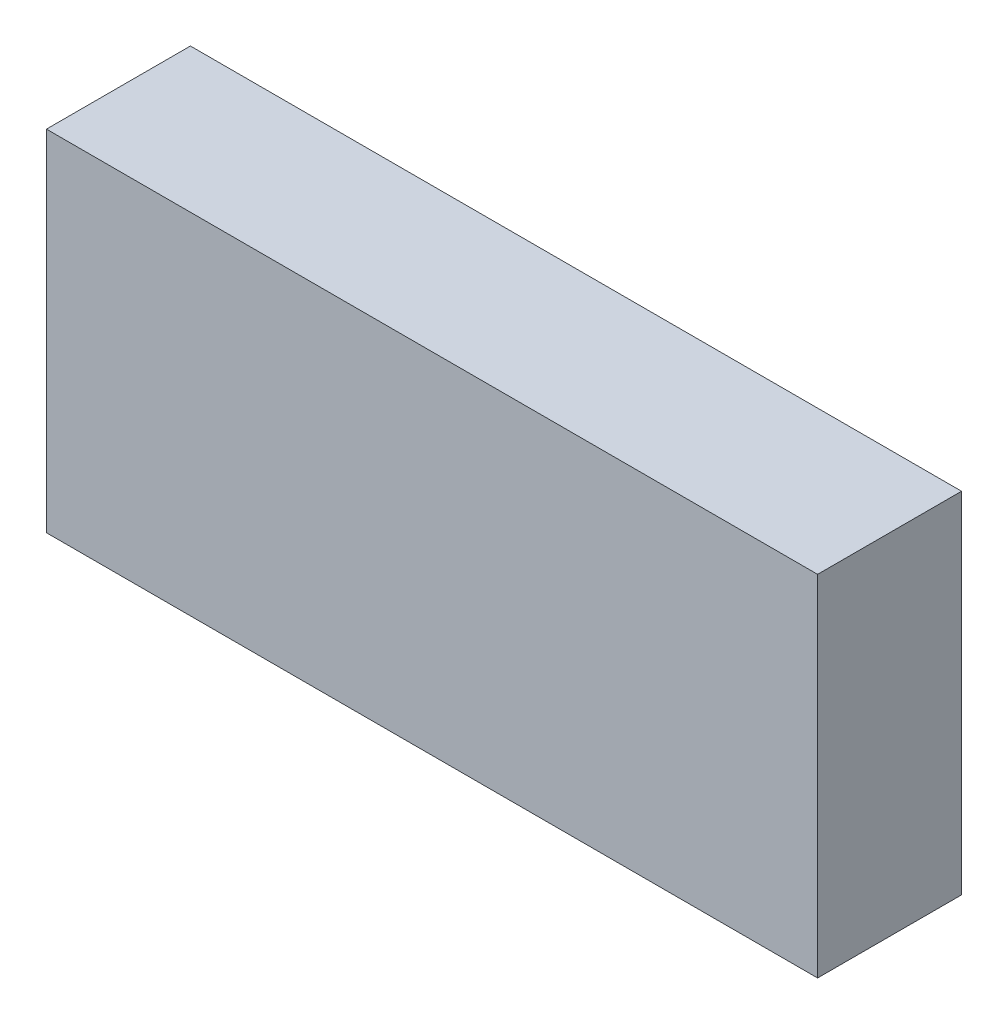
ISO-10303-21;
HEADER;
FILE_DESCRIPTION(('STEP AP214'),'2;1');
FILE_NAME('part.step','',(''),(''),'','','');
FILE_SCHEMA(('AUTOMOTIVE_DESIGN { 1 0 10303 214 1 1 1 1 }'));
ENDSEC;
DATA;
#1=APPLICATION_CONTEXT('core data for automotive mechanical design processes');
#2=APPLICATION_PROTOCOL_DEFINITION('international standard','automotive_design',2000,#1);
#3=PRODUCT_CONTEXT('',#1,'mechanical');
#4=PRODUCT('Part','Part','',(#3));
#5=PRODUCT_RELATED_PRODUCT_CATEGORY('part','',(#4));
#6=PRODUCT_DEFINITION_FORMATION('','',#4);
#7=PRODUCT_DEFINITION_CONTEXT('part definition',#1,'design');
#8=PRODUCT_DEFINITION('design','',#6,#7);
#9=PRODUCT_DEFINITION_SHAPE('','',#8);
#10=(LENGTH_UNIT() NAMED_UNIT(*) SI_UNIT(.MILLI.,.METRE.));
#11=(NAMED_UNIT(*) PLANE_ANGLE_UNIT() SI_UNIT($,.RADIAN.));
#12=(NAMED_UNIT(*) SI_UNIT($,.STERADIAN.) SOLID_ANGLE_UNIT());
#13=UNCERTAINTY_MEASURE_WITH_UNIT(LENGTH_MEASURE(1.E-05),#10,'distance_accuracy_value','');
#14=(GEOMETRIC_REPRESENTATION_CONTEXT(3) GLOBAL_UNCERTAINTY_ASSIGNED_CONTEXT((#13)) GLOBAL_UNIT_ASSIGNED_CONTEXT((#10,
#11,#12)) REPRESENTATION_CONTEXT('',''));
#15=CARTESIAN_POINT('',(0.,0.,0.));
#16=DIRECTION('',(0.,0.,1.));
#17=DIRECTION('',(1.,0.,0.));
#18=AXIS2_PLACEMENT_3D('',#15,#16,#17);
#19=CARTESIAN_POINT('',(0.,0.,7.));
#20=DIRECTION('',(1.,0.,0.));
#21=DIRECTION('',(0.,0.,-1.));
#22=AXIS2_PLACEMENT_3D('',#19,#20,#21);
#23=PLANE('',#22);
#24=DIRECTION('',(0.,-1.,0.));
#25=VECTOR('',#24,1.);
#26=CARTESIAN_POINT('',(0.,0.,0.));
#27=LINE('',#26,#25);
#28=CARTESIAN_POINT('',(0.,17.,0.));
#29=VERTEX_POINT('',#28);
#30=CARTESIAN_POINT('',(0.,0.,0.));
#31=VERTEX_POINT('',#30);
#32=EDGE_CURVE('E96',#29,#31,#27,.T.);
#33=ORIENTED_EDGE('',*,*,#32,.T.);
#34=DIRECTION('',(0.,0.,-1.));
#35=VECTOR('',#34,1.);
#36=CARTESIAN_POINT('',(0.,0.,7.));
#37=LINE('',#36,#35);
#38=CARTESIAN_POINT('',(0.,0.,7.));
#39=VERTEX_POINT('',#38);
#40=EDGE_CURVE('E11',#39,#31,#37,.T.);
#41=ORIENTED_EDGE('',*,*,#40,.F.);
#42=DIRECTION('',(0.,-1.,0.));
#43=VECTOR('',#42,1.);
#44=CARTESIAN_POINT('',(0.,0.,7.));
#45=LINE('',#44,#43);
#46=CARTESIAN_POINT('',(0.,17.,7.));
#47=VERTEX_POINT('',#46);
#48=EDGE_CURVE('E84',#47,#39,#45,.T.);
#49=ORIENTED_EDGE('',*,*,#48,.F.);
#50=DIRECTION('',(0.,0.,-1.));
#51=VECTOR('',#50,1.);
#52=CARTESIAN_POINT('',(0.,17.,7.));
#53=LINE('',#52,#51);
#54=EDGE_CURVE('E92',#47,#29,#53,.T.);
#55=ORIENTED_EDGE('',*,*,#54,.T.);
#56=EDGE_LOOP('',(#33,#41,#49,#55));
#57=FACE_BOUND('',#56,.T.);
#58=ADVANCED_FACE('F33',(#57),#23,.F.);
#59=CARTESIAN_POINT('',(0.,0.,7.));
#60=DIRECTION('',(0.,1.,0.));
#61=DIRECTION('',(0.,0.,1.));
#62=AXIS2_PLACEMENT_3D('',#59,#60,#61);
#63=PLANE('',#62);
#64=DIRECTION('',(1.,0.,0.));
#65=VECTOR('',#64,1.);
#66=CARTESIAN_POINT('',(0.,0.,0.));
#67=LINE('',#66,#65);
#68=CARTESIAN_POINT('',(37.5,0.,0.));
#69=VERTEX_POINT('',#68);
#70=EDGE_CURVE('E88',#31,#69,#67,.T.);
#71=ORIENTED_EDGE('',*,*,#70,.T.);
#72=DIRECTION('',(0.,0.,-1.));
#73=VECTOR('',#72,1.);
#74=CARTESIAN_POINT('',(37.5,0.,7.));
#75=LINE('',#74,#73);
#76=CARTESIAN_POINT('',(37.5,0.,7.));
#77=VERTEX_POINT('',#76);
#78=EDGE_CURVE('E41',#77,#69,#75,.T.);
#79=ORIENTED_EDGE('',*,*,#78,.F.);
#80=DIRECTION('',(1.,0.,0.));
#81=VECTOR('',#80,1.);
#82=CARTESIAN_POINT('',(0.,0.,7.));
#83=LINE('',#82,#81);
#84=EDGE_CURVE('E79',#39,#77,#83,.T.);
#85=ORIENTED_EDGE('',*,*,#84,.F.);
#86=ORIENTED_EDGE('',*,*,#40,.T.);
#87=EDGE_LOOP('',(#71,#79,#85,#86));
#88=FACE_BOUND('',#87,.T.);
#89=ADVANCED_FACE('F87',(#88),#63,.F.);
#90=CARTESIAN_POINT('',(37.5,0.,7.));
#91=DIRECTION('',(-1.,0.,0.));
#92=DIRECTION('',(0.,0.,1.));
#93=AXIS2_PLACEMENT_3D('',#90,#91,#92);
#94=PLANE('',#93);
#95=DIRECTION('',(0.,1.,0.));
#96=VECTOR('',#95,1.);
#97=CARTESIAN_POINT('',(37.5,0.,0.));
#98=LINE('',#97,#96);
#99=CARTESIAN_POINT('',(37.5,17.,0.));
#100=VERTEX_POINT('',#99);
#101=EDGE_CURVE('E66',#69,#100,#98,.T.);
#102=ORIENTED_EDGE('',*,*,#101,.T.);
#103=DIRECTION('',(0.,0.,-1.));
#104=VECTOR('',#103,1.);
#105=CARTESIAN_POINT('',(37.5,17.,7.));
#106=LINE('',#105,#104);
#107=CARTESIAN_POINT('',(37.5,17.,7.));
#108=VERTEX_POINT('',#107);
#109=EDGE_CURVE('E89',#108,#100,#106,.T.);
#110=ORIENTED_EDGE('',*,*,#109,.F.);
#111=DIRECTION('',(0.,1.,0.));
#112=VECTOR('',#111,1.);
#113=CARTESIAN_POINT('',(37.5,0.,7.));
#114=LINE('',#113,#112);
#115=EDGE_CURVE('E82',#77,#108,#114,.T.);
#116=ORIENTED_EDGE('',*,*,#115,.F.);
#117=ORIENTED_EDGE('',*,*,#78,.T.);
#118=EDGE_LOOP('',(#102,#110,#116,#117));
#119=FACE_BOUND('',#118,.T.);
#120=ADVANCED_FACE('F90',(#119),#94,.F.);
#121=CARTESIAN_POINT('',(0.,17.,7.));
#122=DIRECTION('',(0.,-1.,0.));
#123=DIRECTION('',(0.,0.,-1.));
#124=AXIS2_PLACEMENT_3D('',#121,#122,#123);
#125=PLANE('',#124);
#126=DIRECTION('',(-1.,0.,0.));
#127=VECTOR('',#126,1.);
#128=CARTESIAN_POINT('',(0.,17.,0.));
#129=LINE('',#128,#127);
#130=EDGE_CURVE('E72',#100,#29,#129,.T.);
#131=ORIENTED_EDGE('',*,*,#130,.T.);
#132=ORIENTED_EDGE('',*,*,#54,.F.);
#133=DIRECTION('',(-1.,0.,0.));
#134=VECTOR('',#133,1.);
#135=CARTESIAN_POINT('',(0.,17.,7.));
#136=LINE('',#135,#134);
#137=EDGE_CURVE('E49',#108,#47,#136,.T.);
#138=ORIENTED_EDGE('',*,*,#137,.F.);
#139=ORIENTED_EDGE('',*,*,#109,.T.);
#140=EDGE_LOOP('',(#131,#132,#138,#139));
#141=FACE_BOUND('',#140,.T.);
#142=ADVANCED_FACE('F103',(#141),#125,.F.);
#143=CARTESIAN_POINT('',(0.,0.,7.));
#144=DIRECTION('',(0.,0.,-1.));
#145=DIRECTION('',(-1.,0.,0.));
#146=AXIS2_PLACEMENT_3D('',#143,#144,#145);
#147=PLANE('',#146);
#148=ORIENTED_EDGE('',*,*,#48,.T.);
#149=ORIENTED_EDGE('',*,*,#84,.T.);
#150=ORIENTED_EDGE('',*,*,#115,.T.);
#151=ORIENTED_EDGE('',*,*,#137,.T.);
#152=EDGE_LOOP('',(#148,#149,#150,#151));
#153=FACE_BOUND('',#152,.T.);
#154=ADVANCED_FACE('F80',(#153),#147,.F.);
#155=CARTESIAN_POINT('',(0.,0.,0.));
#156=DIRECTION('',(0.,0.,-1.));
#157=DIRECTION('',(-1.,0.,0.));
#158=AXIS2_PLACEMENT_3D('',#155,#156,#157);
#159=PLANE('',#158);
#160=ORIENTED_EDGE('',*,*,#32,.F.);
#161=ORIENTED_EDGE('',*,*,#130,.F.);
#162=ORIENTED_EDGE('',*,*,#101,.F.);
#163=ORIENTED_EDGE('',*,*,#70,.F.);
#164=EDGE_LOOP('',(#160,#161,#162,#163));
#165=FACE_BOUND('',#164,.T.);
#166=ADVANCED_FACE('F106',(#165),#159,.T.);
#167=CLOSED_SHELL('',(#58,#89,#120,#142,#154,#166));
#168=MANIFOLD_SOLID_BREP('B2',#167);
#169=ADVANCED_BREP_SHAPE_REPRESENTATION('',(#18,#168),#14);
#170=SHAPE_DEFINITION_REPRESENTATION(#9,#169);
ENDSEC;
END-ISO-10303-21;
